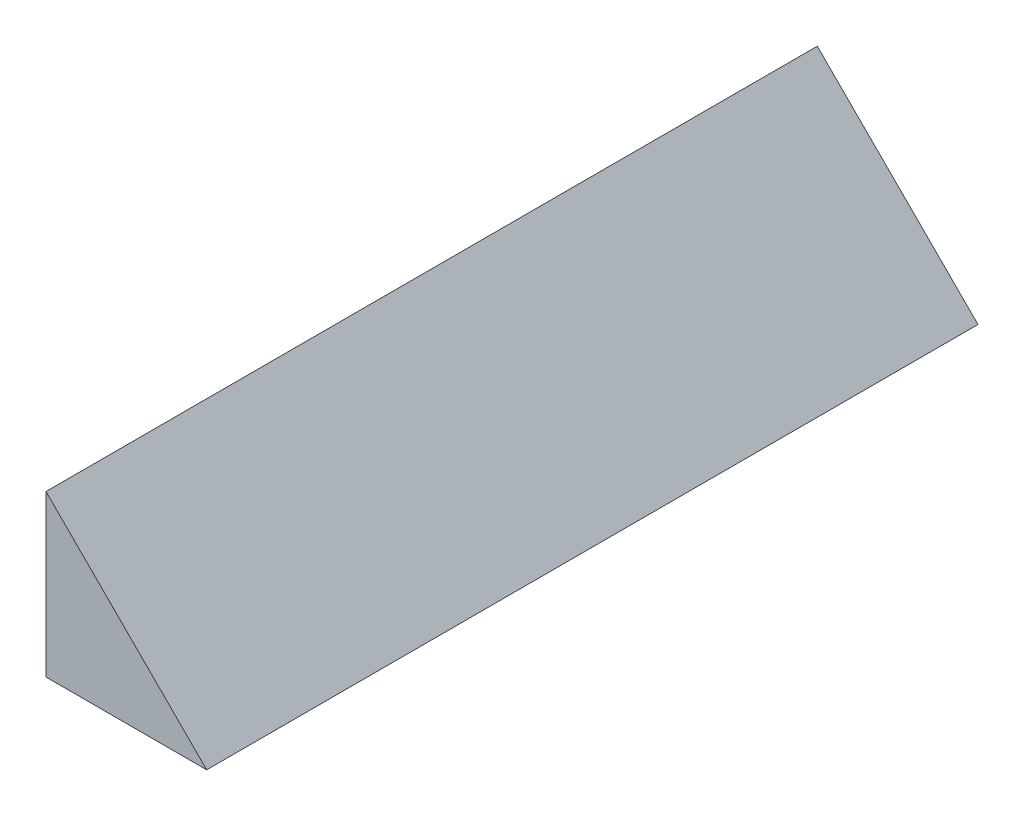
ISO-10303-21;
HEADER;
FILE_DESCRIPTION(('STEP AP214'),'2;1');
FILE_NAME('part.step','',(''),(''),'','','');
FILE_SCHEMA(('AUTOMOTIVE_DESIGN { 1 0 10303 214 1 1 1 1 }'));
ENDSEC;
DATA;
#1=APPLICATION_CONTEXT('core data for automotive mechanical design processes');
#2=APPLICATION_PROTOCOL_DEFINITION('international standard','automotive_design',2000,#1);
#3=PRODUCT_CONTEXT('',#1,'mechanical');
#4=PRODUCT('Part','Part','',(#3));
#5=PRODUCT_RELATED_PRODUCT_CATEGORY('part','',(#4));
#6=PRODUCT_DEFINITION_FORMATION('','',#4);
#7=PRODUCT_DEFINITION_CONTEXT('part definition',#1,'design');
#8=PRODUCT_DEFINITION('design','',#6,#7);
#9=PRODUCT_DEFINITION_SHAPE('','',#8);
#10=(LENGTH_UNIT() NAMED_UNIT(*) SI_UNIT(.MILLI.,.METRE.));
#11=(NAMED_UNIT(*) PLANE_ANGLE_UNIT() SI_UNIT($,.RADIAN.));
#12=(NAMED_UNIT(*) SI_UNIT($,.STERADIAN.) SOLID_ANGLE_UNIT());
#13=UNCERTAINTY_MEASURE_WITH_UNIT(LENGTH_MEASURE(1.E-05),#10,'distance_accuracy_value','');
#14=(GEOMETRIC_REPRESENTATION_CONTEXT(3) GLOBAL_UNCERTAINTY_ASSIGNED_CONTEXT((#13)) GLOBAL_UNIT_ASSIGNED_CONTEXT((#10,
#11,#12)) REPRESENTATION_CONTEXT('',''));
#15=CARTESIAN_POINT('',(0.,0.,0.));
#16=DIRECTION('',(0.,0.,1.));
#17=DIRECTION('',(1.,0.,0.));
#18=AXIS2_PLACEMENT_3D('',#15,#16,#17);
#19=CARTESIAN_POINT('',(0.,0.,24.));
#20=DIRECTION('',(1.,0.,0.));
#21=DIRECTION('',(0.,0.,-1.));
#22=AXIS2_PLACEMENT_3D('',#19,#20,#21);
#23=PLANE('',#22);
#24=DIRECTION('',(0.,-1.,0.));
#25=VECTOR('',#24,1.);
#26=CARTESIAN_POINT('',(0.,0.,0.));
#27=LINE('',#26,#25);
#28=CARTESIAN_POINT('',(0.,5.,0.));
#29=VERTEX_POINT('',#28);
#30=CARTESIAN_POINT('',(0.,0.,0.));
#31=VERTEX_POINT('',#30);
#32=EDGE_CURVE('E82',#29,#31,#27,.T.);
#33=ORIENTED_EDGE('',*,*,#32,.T.);
#34=DIRECTION('',(0.,0.,-1.));
#35=VECTOR('',#34,1.);
#36=CARTESIAN_POINT('',(0.,0.,24.));
#37=LINE('',#36,#35);
#38=CARTESIAN_POINT('',(0.,0.,24.));
#39=VERTEX_POINT('',#38);
#40=EDGE_CURVE('E72',#39,#31,#37,.T.);
#41=ORIENTED_EDGE('',*,*,#40,.F.);
#42=DIRECTION('',(0.,-1.,0.));
#43=VECTOR('',#42,1.);
#44=CARTESIAN_POINT('',(0.,0.,24.));
#45=LINE('',#44,#43);
#46=CARTESIAN_POINT('',(0.,5.,24.));
#47=VERTEX_POINT('',#46);
#48=EDGE_CURVE('E76',#47,#39,#45,.T.);
#49=ORIENTED_EDGE('',*,*,#48,.F.);
#50=DIRECTION('',(0.,0.,-1.));
#51=VECTOR('',#50,1.);
#52=CARTESIAN_POINT('',(0.,5.,24.));
#53=LINE('',#52,#51);
#54=EDGE_CURVE('E75',#47,#29,#53,.T.);
#55=ORIENTED_EDGE('',*,*,#54,.T.);
#56=EDGE_LOOP('',(#33,#41,#49,#55));
#57=FACE_BOUND('',#56,.T.);
#58=ADVANCED_FACE('F32',(#57),#23,.F.);
#59=CARTESIAN_POINT('',(0.,0.,24.));
#60=DIRECTION('',(0.,1.,0.));
#61=DIRECTION('',(0.,0.,1.));
#62=AXIS2_PLACEMENT_3D('',#59,#60,#61);
#63=PLANE('',#62);
#64=DIRECTION('',(1.,0.,0.));
#65=VECTOR('',#64,1.);
#66=CARTESIAN_POINT('',(0.,0.,0.));
#67=LINE('',#66,#65);
#68=CARTESIAN_POINT('',(5.,0.,0.));
#69=VERTEX_POINT('',#68);
#70=EDGE_CURVE('E80',#31,#69,#67,.T.);
#71=ORIENTED_EDGE('',*,*,#70,.T.);
#72=DIRECTION('',(0.,0.,-1.));
#73=VECTOR('',#72,1.);
#74=CARTESIAN_POINT('',(5.,0.,24.));
#75=LINE('',#74,#73);
#76=CARTESIAN_POINT('',(5.,0.,24.));
#77=VERTEX_POINT('',#76);
#78=EDGE_CURVE('E74',#77,#69,#75,.T.);
#79=ORIENTED_EDGE('',*,*,#78,.F.);
#80=DIRECTION('',(1.,0.,0.));
#81=VECTOR('',#80,1.);
#82=CARTESIAN_POINT('',(0.,0.,24.));
#83=LINE('',#82,#81);
#84=EDGE_CURVE('E69',#39,#77,#83,.T.);
#85=ORIENTED_EDGE('',*,*,#84,.F.);
#86=ORIENTED_EDGE('',*,*,#40,.T.);
#87=EDGE_LOOP('',(#71,#79,#85,#86));
#88=FACE_BOUND('',#87,.T.);
#89=ADVANCED_FACE('F70',(#88),#63,.F.);
#90=CARTESIAN_POINT('',(0.,0.,24.));
#91=DIRECTION('',(0.,0.,-1.));
#92=DIRECTION('',(-1.,0.,0.));
#93=AXIS2_PLACEMENT_3D('',#90,#91,#92);
#94=PLANE('',#93);
#95=ORIENTED_EDGE('',*,*,#84,.T.);
#96=DIRECTION('',(0.707106781186546,-0.707106781186549,0.));
#97=VECTOR('',#96,1.);
#98=CARTESIAN_POINT('',(0.,5.,24.));
#99=LINE('',#98,#97);
#100=EDGE_CURVE('E11',#77,#47,#99,.F.);
#101=ORIENTED_EDGE('',*,*,#100,.T.);
#102=ORIENTED_EDGE('',*,*,#48,.T.);
#103=EDGE_LOOP('',(#95,#101,#102));
#104=FACE_BOUND('',#103,.T.);
#105=ADVANCED_FACE('F78',(#104),#94,.F.);
#106=CARTESIAN_POINT('',(0.,0.,0.));
#107=DIRECTION('',(0.,0.,-1.));
#108=DIRECTION('',(-1.,0.,0.));
#109=AXIS2_PLACEMENT_3D('',#106,#107,#108);
#110=PLANE('',#109);
#111=ORIENTED_EDGE('',*,*,#32,.F.);
#112=DIRECTION('',(-0.707106781186546,0.707106781186549,0.));
#113=VECTOR('',#112,1.);
#114=CARTESIAN_POINT('',(2.5,2.49999999999999,0.));
#115=LINE('',#114,#113);
#116=EDGE_CURVE('E41',#29,#69,#115,.F.);
#117=ORIENTED_EDGE('',*,*,#116,.T.);
#118=ORIENTED_EDGE('',*,*,#70,.F.);
#119=EDGE_LOOP('',(#111,#117,#118));
#120=FACE_BOUND('',#119,.T.);
#121=ADVANCED_FACE('F88',(#120),#110,.T.);
#122=CARTESIAN_POINT('',(0.,5.,24.));
#123=DIRECTION('',(-0.707106781186549,-0.707106781186546,0.));
#124=DIRECTION('',(0.,0.,-1.));
#125=AXIS2_PLACEMENT_3D('',#122,#123,#124);
#126=PLANE('',#125);
#127=ORIENTED_EDGE('',*,*,#100,.F.);
#128=ORIENTED_EDGE('',*,*,#78,.T.);
#129=ORIENTED_EDGE('',*,*,#116,.F.);
#130=ORIENTED_EDGE('',*,*,#54,.F.);
#131=EDGE_LOOP('',(#127,#128,#129,#130));
#132=FACE_BOUND('',#131,.T.);
#133=ADVANCED_FACE('F34',(#132),#126,.F.);
#134=CLOSED_SHELL('',(#58,#89,#105,#121,#133));
#135=MANIFOLD_SOLID_BREP('B2',#134);
#136=ADVANCED_BREP_SHAPE_REPRESENTATION('',(#18,#135),#14);
#137=SHAPE_DEFINITION_REPRESENTATION(#9,#136);
ENDSEC;
END-ISO-10303-21;
